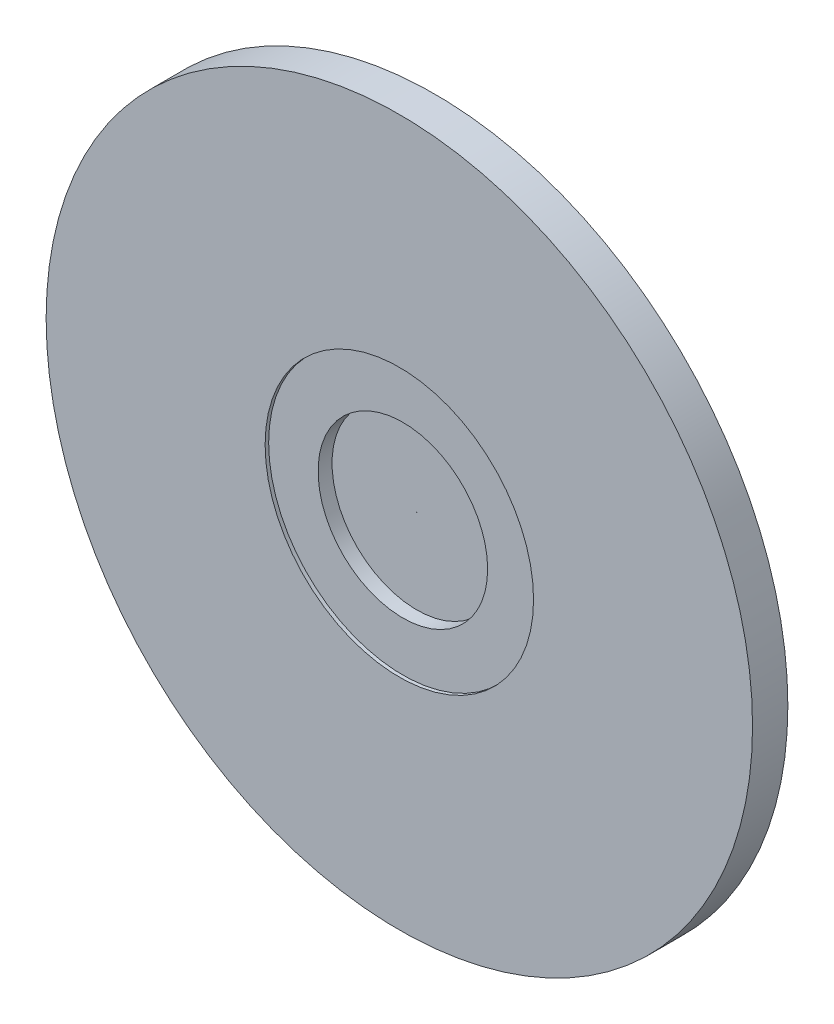
ISO-10303-21;
HEADER;
FILE_DESCRIPTION(('STEP AP214'),'2;1');
FILE_NAME('part.step','',(''),(''),'','','');
FILE_SCHEMA(('AUTOMOTIVE_DESIGN { 1 0 10303 214 1 1 1 1 }'));
ENDSEC;
DATA;
#1=APPLICATION_CONTEXT('core data for automotive mechanical design processes');
#2=APPLICATION_PROTOCOL_DEFINITION('international standard','automotive_design',2000,#1);
#3=PRODUCT_CONTEXT('',#1,'mechanical');
#4=PRODUCT('Part','Part','',(#3));
#5=PRODUCT_RELATED_PRODUCT_CATEGORY('part','',(#4));
#6=PRODUCT_DEFINITION_FORMATION('','',#4);
#7=PRODUCT_DEFINITION_CONTEXT('part definition',#1,'design');
#8=PRODUCT_DEFINITION('design','',#6,#7);
#9=PRODUCT_DEFINITION_SHAPE('','',#8);
#10=(LENGTH_UNIT() NAMED_UNIT(*) SI_UNIT(.MILLI.,.METRE.));
#11=(NAMED_UNIT(*) PLANE_ANGLE_UNIT() SI_UNIT($,.RADIAN.));
#12=(NAMED_UNIT(*) SI_UNIT($,.STERADIAN.) SOLID_ANGLE_UNIT());
#13=UNCERTAINTY_MEASURE_WITH_UNIT(LENGTH_MEASURE(1.E-05),#10,'distance_accuracy_value','');
#14=(GEOMETRIC_REPRESENTATION_CONTEXT(3) GLOBAL_UNCERTAINTY_ASSIGNED_CONTEXT((#13)) GLOBAL_UNIT_ASSIGNED_CONTEXT((#10,
#11,#12)) REPRESENTATION_CONTEXT('',''));
#15=CARTESIAN_POINT('',(0.,0.,0.));
#16=DIRECTION('',(0.,0.,1.));
#17=DIRECTION('',(1.,0.,0.));
#18=AXIS2_PLACEMENT_3D('',#15,#16,#17);
#19=CARTESIAN_POINT('',(0.,0.,-0.00634999999999999));
#20=DIRECTION('',(0.,0.,1.));
#21=DIRECTION('',(1.,0.,0.));
#22=AXIS2_PLACEMENT_3D('',#19,#20,#21);
#23=PLANE('',#22);
#24=CARTESIAN_POINT('',(0.,0.,-0.00635000000000219));
#25=DIRECTION('',(0.,0.,1.));
#26=DIRECTION('',(1.,0.,0.));
#27=AXIS2_PLACEMENT_3D('',#24,#25,#26);
#28=CIRCLE('',#27,3.);
#29=CARTESIAN_POINT('',(3.,0.,-0.00635000000000219));
#30=VERTEX_POINT('',#29);
#31=EDGE_CURVE('E53',#30,#30,#28,.F.);
#32=ORIENTED_EDGE('',*,*,#31,.T.);
#33=EDGE_LOOP('',(#32));
#34=FACE_BOUND('',#33,.T.);
#35=CARTESIAN_POINT('',(0.,0.,-0.00635000000000002));
#36=DIRECTION('',(0.,0.,1.));
#37=DIRECTION('',(1.,0.,0.));
#38=AXIS2_PLACEMENT_3D('',#35,#36,#37);
#39=CIRCLE('',#38,0.0075);
#40=CARTESIAN_POINT('',(0.0075,0.,-0.00635000000000002));
#41=VERTEX_POINT('',#40);
#42=EDGE_CURVE('E19',#41,#41,#39,.T.);
#43=ORIENTED_EDGE('',*,*,#42,.T.);
#44=EDGE_LOOP('',(#43));
#45=FACE_BOUND('',#44,.T.);
#46=ADVANCED_FACE('F16',(#34,#45),#23,.F.);
#47=CARTESIAN_POINT('',(0.,0.,-0.625000000000001));
#48=DIRECTION('',(0.,0.,1.));
#49=DIRECTION('',(1.,0.,0.));
#50=AXIS2_PLACEMENT_3D('',#47,#48,#49);
#51=CYLINDRICAL_SURFACE('',#50,0.0075);
#52=ORIENTED_EDGE('',*,*,#42,.F.);
#53=EDGE_LOOP('',(#52));
#54=FACE_BOUND('',#53,.T.);
#55=CARTESIAN_POINT('',(0.,0.,0.00635000000000056));
#56=DIRECTION('',(0.,0.,1.));
#57=DIRECTION('',(1.,0.,0.));
#58=AXIS2_PLACEMENT_3D('',#55,#56,#57);
#59=CIRCLE('',#58,0.0075);
#60=CARTESIAN_POINT('',(0.0075,0.,0.00635000000000056));
#61=VERTEX_POINT('',#60);
#62=EDGE_CURVE('E51',#61,#61,#59,.T.);
#63=ORIENTED_EDGE('',*,*,#62,.T.);
#64=EDGE_LOOP('',(#63));
#65=FACE_BOUND('',#64,.T.);
#66=ADVANCED_FACE('F61',(#54,#65),#51,.F.);
#67=CARTESIAN_POINT('',(0.,0.,96.7346302925711));
#68=DIRECTION('',(0.,0.,1.));
#69=DIRECTION('',(1.,0.,0.));
#70=AXIS2_PLACEMENT_3D('',#67,#68,#69);
#71=CYLINDRICAL_SURFACE('',#70,3.);
#72=CARTESIAN_POINT('',(0.,0.,-0.5));
#73=DIRECTION('',(0.,0.,1.));
#74=DIRECTION('',(1.,0.,0.));
#75=AXIS2_PLACEMENT_3D('',#72,#73,#74);
#76=CIRCLE('',#75,3.);
#77=CARTESIAN_POINT('',(3.,0.,-0.5));
#78=VERTEX_POINT('',#77);
#79=EDGE_CURVE('E48',#78,#78,#76,.F.);
#80=ORIENTED_EDGE('',*,*,#79,.T.);
#81=EDGE_LOOP('',(#80));
#82=FACE_BOUND('',#81,.T.);
#83=ORIENTED_EDGE('',*,*,#31,.F.);
#84=EDGE_LOOP('',(#83));
#85=FACE_BOUND('',#84,.T.);
#86=ADVANCED_FACE('F64',(#82,#85),#71,.F.);
#87=CARTESIAN_POINT('',(0.,0.,0.00635000000000055));
#88=DIRECTION('',(0.,0.,-1.));
#89=DIRECTION('',(-1.,0.,0.));
#90=AXIS2_PLACEMENT_3D('',#87,#88,#89);
#91=PLANE('',#90);
#92=CARTESIAN_POINT('',(0.,0.,0.00635000000000219));
#93=DIRECTION('',(0.,0.,1.));
#94=DIRECTION('',(1.,0.,0.));
#95=AXIS2_PLACEMENT_3D('',#92,#93,#94);
#96=CIRCLE('',#95,3.);
#97=CARTESIAN_POINT('',(3.,0.,0.00635000000000219));
#98=VERTEX_POINT('',#97);
#99=EDGE_CURVE('E45',#98,#98,#96,.T.);
#100=ORIENTED_EDGE('',*,*,#99,.T.);
#101=EDGE_LOOP('',(#100));
#102=FACE_BOUND('',#101,.T.);
#103=ORIENTED_EDGE('',*,*,#62,.F.);
#104=EDGE_LOOP('',(#103));
#105=FACE_BOUND('',#104,.T.);
#106=ADVANCED_FACE('F67',(#102,#105),#91,.F.);
#107=CARTESIAN_POINT('',(0.,3.,-0.5));
#108=DIRECTION('',(0.,0.,1.));
#109=DIRECTION('',(1.,0.,0.));
#110=AXIS2_PLACEMENT_3D('',#107,#108,#109);
#111=PLANE('',#110);
#112=ORIENTED_EDGE('',*,*,#79,.F.);
#113=EDGE_LOOP('',(#112));
#114=FACE_BOUND('',#113,.T.);
#115=CARTESIAN_POINT('',(0.,0.,-0.5));
#116=DIRECTION('',(0.,0.,1.));
#117=DIRECTION('',(1.,0.,0.));
#118=AXIS2_PLACEMENT_3D('',#115,#116,#117);
#119=CIRCLE('',#118,4.75);
#120=CARTESIAN_POINT('',(4.75,0.,-0.5));
#121=VERTEX_POINT('',#120);
#122=EDGE_CURVE('E42',#121,#121,#119,.F.);
#123=ORIENTED_EDGE('',*,*,#122,.T.);
#124=EDGE_LOOP('',(#123));
#125=FACE_BOUND('',#124,.T.);
#126=ADVANCED_FACE('F69',(#114,#125),#111,.F.);
#127=CARTESIAN_POINT('',(0.,0.,96.7346302925711));
#128=DIRECTION('',(0.,0.,1.));
#129=DIRECTION('',(1.,0.,0.));
#130=AXIS2_PLACEMENT_3D('',#127,#128,#129);
#131=CYLINDRICAL_SURFACE('',#130,3.);
#132=ORIENTED_EDGE('',*,*,#99,.F.);
#133=EDGE_LOOP('',(#132));
#134=FACE_BOUND('',#133,.T.);
#135=CARTESIAN_POINT('',(0.,0.,0.5));
#136=DIRECTION('',(0.,0.,1.));
#137=DIRECTION('',(1.,0.,0.));
#138=AXIS2_PLACEMENT_3D('',#135,#136,#137);
#139=CIRCLE('',#138,3.);
#140=CARTESIAN_POINT('',(3.,0.,0.5));
#141=VERTEX_POINT('',#140);
#142=EDGE_CURVE('E39',#141,#141,#139,.T.);
#143=ORIENTED_EDGE('',*,*,#142,.T.);
#144=EDGE_LOOP('',(#143));
#145=FACE_BOUND('',#144,.T.);
#146=ADVANCED_FACE('F77',(#134,#145),#131,.F.);
#147=CARTESIAN_POINT('',(0.,0.,96.7346302925711));
#148=DIRECTION('',(0.,0.,1.));
#149=DIRECTION('',(1.,0.,0.));
#150=AXIS2_PLACEMENT_3D('',#147,#148,#149);
#151=CYLINDRICAL_SURFACE('',#150,4.75);
#152=CARTESIAN_POINT('',(0.,0.,-0.625000000000001));
#153=DIRECTION('',(0.,0.,1.));
#154=DIRECTION('',(1.,0.,0.));
#155=AXIS2_PLACEMENT_3D('',#152,#153,#154);
#156=CIRCLE('',#155,4.75);
#157=CARTESIAN_POINT('',(4.75,0.,-0.625000000000001));
#158=VERTEX_POINT('',#157);
#159=EDGE_CURVE('E36',#158,#158,#156,.F.);
#160=ORIENTED_EDGE('',*,*,#159,.T.);
#161=EDGE_LOOP('',(#160));
#162=FACE_BOUND('',#161,.T.);
#163=ORIENTED_EDGE('',*,*,#122,.F.);
#164=EDGE_LOOP('',(#163));
#165=FACE_BOUND('',#164,.T.);
#166=ADVANCED_FACE('F104',(#162,#165),#151,.F.);
#167=CARTESIAN_POINT('',(0.,3.,0.5));
#168=DIRECTION('',(0.,0.,-1.));
#169=DIRECTION('',(-1.,0.,0.));
#170=AXIS2_PLACEMENT_3D('',#167,#168,#169);
#171=PLANE('',#170);
#172=CARTESIAN_POINT('',(0.,0.,0.5));
#173=DIRECTION('',(0.,0.,1.));
#174=DIRECTION('',(1.,0.,0.));
#175=AXIS2_PLACEMENT_3D('',#172,#173,#174);
#176=CIRCLE('',#175,4.75);
#177=CARTESIAN_POINT('',(4.75,0.,0.5));
#178=VERTEX_POINT('',#177);
#179=EDGE_CURVE('E33',#178,#178,#176,.T.);
#180=ORIENTED_EDGE('',*,*,#179,.T.);
#181=EDGE_LOOP('',(#180));
#182=FACE_BOUND('',#181,.T.);
#183=ORIENTED_EDGE('',*,*,#142,.F.);
#184=EDGE_LOOP('',(#183));
#185=FACE_BOUND('',#184,.T.);
#186=ADVANCED_FACE('F100',(#182,#185),#171,.F.);
#187=CARTESIAN_POINT('',(0.,4.75,-0.625));
#188=DIRECTION('',(0.,0.,1.));
#189=DIRECTION('',(1.,0.,0.));
#190=AXIS2_PLACEMENT_3D('',#187,#188,#189);
#191=PLANE('',#190);
#192=ORIENTED_EDGE('',*,*,#159,.F.);
#193=EDGE_LOOP('',(#192));
#194=FACE_BOUND('',#193,.T.);
#195=CARTESIAN_POINT('',(0.,0.,-0.625000000000001));
#196=DIRECTION('',(0.,0.,1.));
#197=DIRECTION('',(1.,0.,0.));
#198=AXIS2_PLACEMENT_3D('',#195,#196,#197);
#199=CIRCLE('',#198,12.5);
#200=CARTESIAN_POINT('',(12.5,0.,-0.625000000000001));
#201=VERTEX_POINT('',#200);
#202=EDGE_CURVE('E28',#201,#201,#199,.T.);
#203=ORIENTED_EDGE('',*,*,#202,.F.);
#204=EDGE_LOOP('',(#203));
#205=FACE_BOUND('',#204,.T.);
#206=ADVANCED_FACE('F96',(#194,#205),#191,.F.);
#207=CARTESIAN_POINT('',(0.,0.,96.7346302925711));
#208=DIRECTION('',(0.,0.,1.));
#209=DIRECTION('',(1.,0.,0.));
#210=AXIS2_PLACEMENT_3D('',#207,#208,#209);
#211=CYLINDRICAL_SURFACE('',#210,4.75);
#212=ORIENTED_EDGE('',*,*,#179,.F.);
#213=EDGE_LOOP('',(#212));
#214=FACE_BOUND('',#213,.T.);
#215=CARTESIAN_POINT('',(0.,0.,0.625000000000001));
#216=DIRECTION('',(0.,0.,1.));
#217=DIRECTION('',(1.,0.,0.));
#218=AXIS2_PLACEMENT_3D('',#215,#216,#217);
#219=CIRCLE('',#218,4.75);
#220=CARTESIAN_POINT('',(4.75,0.,0.625000000000001));
#221=VERTEX_POINT('',#220);
#222=EDGE_CURVE('E23',#221,#221,#219,.T.);
#223=ORIENTED_EDGE('',*,*,#222,.T.);
#224=EDGE_LOOP('',(#223));
#225=FACE_BOUND('',#224,.T.);
#226=ADVANCED_FACE('F90',(#214,#225),#211,.F.);
#227=CARTESIAN_POINT('',(0.,0.,96.7346302925711));
#228=DIRECTION('',(0.,0.,1.));
#229=DIRECTION('',(1.,0.,0.));
#230=AXIS2_PLACEMENT_3D('',#227,#228,#229);
#231=CYLINDRICAL_SURFACE('',#230,12.5);
#232=CARTESIAN_POINT('',(0.,0.,0.625000000000001));
#233=DIRECTION('',(0.,0.,1.));
#234=DIRECTION('',(1.,0.,0.));
#235=AXIS2_PLACEMENT_3D('',#232,#233,#234);
#236=CIRCLE('',#235,12.5);
#237=CARTESIAN_POINT('',(12.5,0.,0.625000000000001));
#238=VERTEX_POINT('',#237);
#239=EDGE_CURVE('E10',#238,#238,#236,.F.);
#240=ORIENTED_EDGE('',*,*,#239,.T.);
#241=EDGE_LOOP('',(#240));
#242=FACE_BOUND('',#241,.T.);
#243=ORIENTED_EDGE('',*,*,#202,.T.);
#244=EDGE_LOOP('',(#243));
#245=FACE_BOUND('',#244,.T.);
#246=ADVANCED_FACE('F84',(#242,#245),#231,.T.);
#247=CARTESIAN_POINT('',(0.,4.75,0.625));
#248=DIRECTION('',(0.,0.,-1.));
#249=DIRECTION('',(-1.,0.,0.));
#250=AXIS2_PLACEMENT_3D('',#247,#248,#249);
#251=PLANE('',#250);
#252=ORIENTED_EDGE('',*,*,#239,.F.);
#253=EDGE_LOOP('',(#252));
#254=FACE_BOUND('',#253,.T.);
#255=ORIENTED_EDGE('',*,*,#222,.F.);
#256=EDGE_LOOP('',(#255));
#257=FACE_BOUND('',#256,.T.);
#258=ADVANCED_FACE('F82',(#254,#257),#251,.F.);
#259=CLOSED_SHELL('',(#46,#66,#86,#106,#126,#146,#166,#186,#206,#226,#246,#258));
#260=MANIFOLD_SOLID_BREP('B1',#259);
#261=ADVANCED_BREP_SHAPE_REPRESENTATION('',(#18,#260),#14);
#262=SHAPE_DEFINITION_REPRESENTATION(#9,#261);
ENDSEC;
END-ISO-10303-21;
